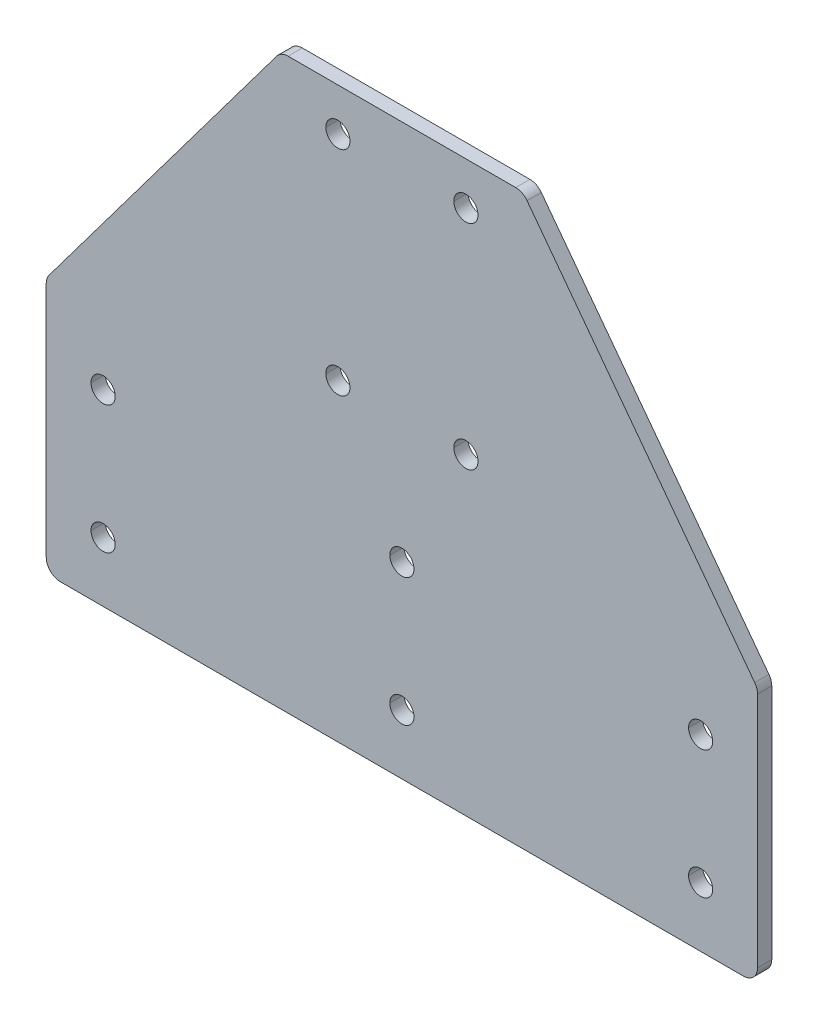
ISO-10303-21;
HEADER;
FILE_DESCRIPTION(('STEP AP214'),'2;1');
FILE_NAME('part.step','',(''),(''),'','','');
FILE_SCHEMA(('AUTOMOTIVE_DESIGN { 1 0 10303 214 1 1 1 1 }'));
ENDSEC;
DATA;
#1=APPLICATION_CONTEXT('core data for automotive mechanical design processes');
#2=APPLICATION_PROTOCOL_DEFINITION('international standard','automotive_design',2000,#1);
#3=PRODUCT_CONTEXT('',#1,'mechanical');
#4=PRODUCT('Part','Part','',(#3));
#5=PRODUCT_RELATED_PRODUCT_CATEGORY('part','',(#4));
#6=PRODUCT_DEFINITION_FORMATION('','',#4);
#7=PRODUCT_DEFINITION_CONTEXT('part definition',#1,'design');
#8=PRODUCT_DEFINITION('design','',#6,#7);
#9=PRODUCT_DEFINITION_SHAPE('','',#8);
#10=(LENGTH_UNIT() NAMED_UNIT(*) SI_UNIT(.MILLI.,.METRE.));
#11=(NAMED_UNIT(*) PLANE_ANGLE_UNIT() SI_UNIT($,.RADIAN.));
#12=(NAMED_UNIT(*) SI_UNIT($,.STERADIAN.) SOLID_ANGLE_UNIT());
#13=UNCERTAINTY_MEASURE_WITH_UNIT(LENGTH_MEASURE(1.E-05),#10,'distance_accuracy_value','');
#14=(GEOMETRIC_REPRESENTATION_CONTEXT(3) GLOBAL_UNCERTAINTY_ASSIGNED_CONTEXT((#13)) GLOBAL_UNIT_ASSIGNED_CONTEXT((#10,
#11,#12)) REPRESENTATION_CONTEXT('',''));
#15=CARTESIAN_POINT('',(0.,0.,0.));
#16=DIRECTION('',(0.,0.,1.));
#17=DIRECTION('',(1.,0.,0.));
#18=AXIS2_PLACEMENT_3D('',#15,#16,#17);
#19=CARTESIAN_POINT('',(230.004921564745,21.,5.));
#20=DIRECTION('',(0.,0.,-1.));
#21=DIRECTION('',(-1.,0.,0.));
#22=AXIS2_PLACEMENT_3D('',#19,#20,#21);
#23=CYLINDRICAL_SURFACE('',#22,4.25);
#24=DIRECTION('',(0.,0.,-1.));
#25=VECTOR('',#24,1.);
#26=CARTESIAN_POINT('',(234.254921564745,21.,5.));
#27=LINE('',#26,#25);
#28=CARTESIAN_POINT('',(234.254921564745,21.,5.));
#29=VERTEX_POINT('',#28);
#30=CARTESIAN_POINT('',(234.254921564745,21.,0.));
#31=VERTEX_POINT('',#30);
#32=EDGE_CURVE('E618',#29,#31,#27,.T.);
#33=ORIENTED_EDGE('',*,*,#32,.F.);
#34=CARTESIAN_POINT('',(230.004921564745,21.,5.));
#35=DIRECTION('',(0.,0.,1.));
#36=DIRECTION('',(-1.,0.,0.));
#37=AXIS2_PLACEMENT_3D('',#34,#35,#36);
#38=CIRCLE('',#37,4.25);
#39=CARTESIAN_POINT('',(225.754921564745,21.,5.));
#40=VERTEX_POINT('',#39);
#41=EDGE_CURVE('E449',#29,#40,#38,.T.);
#42=ORIENTED_EDGE('',*,*,#41,.T.);
#43=DIRECTION('',(0.,0.,-1.));
#44=VECTOR('',#43,1.);
#45=CARTESIAN_POINT('',(225.754921564745,21.,5.));
#46=LINE('',#45,#44);
#47=CARTESIAN_POINT('',(225.754921564745,21.,0.));
#48=VERTEX_POINT('',#47);
#49=EDGE_CURVE('E625',#40,#48,#46,.T.);
#50=ORIENTED_EDGE('',*,*,#49,.T.);
#51=CARTESIAN_POINT('',(230.004921564745,21.,0.));
#52=DIRECTION('',(0.,0.,1.));
#53=DIRECTION('',(-1.,0.,0.));
#54=AXIS2_PLACEMENT_3D('',#51,#52,#53);
#55=CIRCLE('',#54,4.25);
#56=EDGE_CURVE('E309',#31,#48,#55,.T.);
#57=ORIENTED_EDGE('',*,*,#56,.F.);
#58=EDGE_LOOP('',(#33,#42,#50,#57));
#59=FACE_BOUND('',#58,.T.);
#60=ADVANCED_FACE('F16',(#59),#23,.F.);
#61=CARTESIAN_POINT('',(230.004921564745,66.,5.));
#62=DIRECTION('',(0.,0.,-1.));
#63=DIRECTION('',(-1.,0.,0.));
#64=AXIS2_PLACEMENT_3D('',#61,#62,#63);
#65=CYLINDRICAL_SURFACE('',#64,4.25);
#66=DIRECTION('',(0.,0.,-1.));
#67=VECTOR('',#66,1.);
#68=CARTESIAN_POINT('',(234.254921564745,66.,5.));
#69=LINE('',#68,#67);
#70=CARTESIAN_POINT('',(234.254921564745,66.,5.));
#71=VERTEX_POINT('',#70);
#72=CARTESIAN_POINT('',(234.254921564745,66.,0.));
#73=VERTEX_POINT('',#72);
#74=EDGE_CURVE('E332',#71,#73,#69,.T.);
#75=ORIENTED_EDGE('',*,*,#74,.F.);
#76=CARTESIAN_POINT('',(230.004921564745,66.,5.));
#77=DIRECTION('',(0.,0.,1.));
#78=DIRECTION('',(-1.,0.,0.));
#79=AXIS2_PLACEMENT_3D('',#76,#77,#78);
#80=CIRCLE('',#79,4.25);
#81=CARTESIAN_POINT('',(225.754921564745,66.,5.));
#82=VERTEX_POINT('',#81);
#83=EDGE_CURVE('E545',#71,#82,#80,.T.);
#84=ORIENTED_EDGE('',*,*,#83,.T.);
#85=DIRECTION('',(0.,0.,-1.));
#86=VECTOR('',#85,1.);
#87=CARTESIAN_POINT('',(225.754921564745,66.,5.));
#88=LINE('',#87,#86);
#89=CARTESIAN_POINT('',(225.754921564745,66.,0.));
#90=VERTEX_POINT('',#89);
#91=EDGE_CURVE('E328',#82,#90,#88,.T.);
#92=ORIENTED_EDGE('',*,*,#91,.T.);
#93=CARTESIAN_POINT('',(230.004921564745,66.,0.));
#94=DIRECTION('',(0.,0.,1.));
#95=DIRECTION('',(-1.,0.,0.));
#96=AXIS2_PLACEMENT_3D('',#93,#94,#95);
#97=CIRCLE('',#96,4.25);
#98=EDGE_CURVE('E486',#73,#90,#97,.T.);
#99=ORIENTED_EDGE('',*,*,#98,.F.);
#100=EDGE_LOOP('',(#75,#84,#92,#99));
#101=FACE_BOUND('',#100,.T.);
#102=ADVANCED_FACE('F709',(#101),#65,.F.);
#103=CARTESIAN_POINT('',(19.995078435255,66.,5.));
#104=DIRECTION('',(0.,0.,-1.));
#105=DIRECTION('',(-1.,0.,0.));
#106=AXIS2_PLACEMENT_3D('',#103,#104,#105);
#107=CYLINDRICAL_SURFACE('',#106,4.25);
#108=DIRECTION('',(0.,0.,-1.));
#109=VECTOR('',#108,1.);
#110=CARTESIAN_POINT('',(24.245078435255,66.,5.));
#111=LINE('',#110,#109);
#112=CARTESIAN_POINT('',(24.245078435255,66.,5.));
#113=VERTEX_POINT('',#112);
#114=CARTESIAN_POINT('',(24.245078435255,66.,0.));
#115=VERTEX_POINT('',#114);
#116=EDGE_CURVE('E302',#113,#115,#111,.T.);
#117=ORIENTED_EDGE('',*,*,#116,.F.);
#118=CARTESIAN_POINT('',(19.995078435255,66.,5.));
#119=DIRECTION('',(0.,0.,1.));
#120=DIRECTION('',(1.,0.,0.));
#121=AXIS2_PLACEMENT_3D('',#118,#119,#120);
#122=CIRCLE('',#121,4.25);
#123=CARTESIAN_POINT('',(15.745078435255,66.,5.));
#124=VERTEX_POINT('',#123);
#125=EDGE_CURVE('E452',#113,#124,#122,.T.);
#126=ORIENTED_EDGE('',*,*,#125,.T.);
#127=DIRECTION('',(0.,0.,-1.));
#128=VECTOR('',#127,1.);
#129=CARTESIAN_POINT('',(15.745078435255,66.,5.));
#130=LINE('',#129,#128);
#131=CARTESIAN_POINT('',(15.745078435255,66.,0.));
#132=VERTEX_POINT('',#131);
#133=EDGE_CURVE('E305',#124,#132,#130,.T.);
#134=ORIENTED_EDGE('',*,*,#133,.T.);
#135=CARTESIAN_POINT('',(19.995078435255,66.,0.));
#136=DIRECTION('',(0.,0.,1.));
#137=DIRECTION('',(1.,0.,0.));
#138=AXIS2_PLACEMENT_3D('',#135,#136,#137);
#139=CIRCLE('',#138,4.25);
#140=EDGE_CURVE('E298',#115,#132,#139,.T.);
#141=ORIENTED_EDGE('',*,*,#140,.F.);
#142=EDGE_LOOP('',(#117,#126,#134,#141));
#143=FACE_BOUND('',#142,.T.);
#144=ADVANCED_FACE('F300',(#143),#107,.F.);
#145=CARTESIAN_POINT('',(19.995078435255,21.,5.));
#146=DIRECTION('',(0.,0.,-1.));
#147=DIRECTION('',(-1.,0.,0.));
#148=AXIS2_PLACEMENT_3D('',#145,#146,#147);
#149=CYLINDRICAL_SURFACE('',#148,4.25);
#150=DIRECTION('',(0.,0.,-1.));
#151=VECTOR('',#150,1.);
#152=CARTESIAN_POINT('',(24.245078435255,21.,5.));
#153=LINE('',#152,#151);
#154=CARTESIAN_POINT('',(24.245078435255,21.,5.));
#155=VERTEX_POINT('',#154);
#156=CARTESIAN_POINT('',(24.245078435255,21.,0.));
#157=VERTEX_POINT('',#156);
#158=EDGE_CURVE('E358',#155,#157,#153,.T.);
#159=ORIENTED_EDGE('',*,*,#158,.F.);
#160=CARTESIAN_POINT('',(19.995078435255,21.,5.));
#161=DIRECTION('',(0.,0.,1.));
#162=DIRECTION('',(1.,0.,0.));
#163=AXIS2_PLACEMENT_3D('',#160,#161,#162);
#164=CIRCLE('',#163,4.25);
#165=CARTESIAN_POINT('',(15.745078435255,21.,5.));
#166=VERTEX_POINT('',#165);
#167=EDGE_CURVE('E508',#155,#166,#164,.T.);
#168=ORIENTED_EDGE('',*,*,#167,.T.);
#169=DIRECTION('',(0.,0.,-1.));
#170=VECTOR('',#169,1.);
#171=CARTESIAN_POINT('',(15.745078435255,21.,5.));
#172=LINE('',#171,#170);
#173=CARTESIAN_POINT('',(15.745078435255,21.,0.));
#174=VERTEX_POINT('',#173);
#175=EDGE_CURVE('E343',#166,#174,#172,.T.);
#176=ORIENTED_EDGE('',*,*,#175,.T.);
#177=CARTESIAN_POINT('',(19.995078435255,21.,0.));
#178=DIRECTION('',(0.,0.,1.));
#179=DIRECTION('',(1.,0.,0.));
#180=AXIS2_PLACEMENT_3D('',#177,#178,#179);
#181=CIRCLE('',#180,4.25);
#182=EDGE_CURVE('E482',#157,#174,#181,.T.);
#183=ORIENTED_EDGE('',*,*,#182,.F.);
#184=EDGE_LOOP('',(#159,#168,#176,#183));
#185=FACE_BOUND('',#184,.T.);
#186=ADVANCED_FACE('F1226',(#185),#149,.F.);
#187=CARTESIAN_POINT('',(125.,21.,5.));
#188=DIRECTION('',(0.,0.,-1.));
#189=DIRECTION('',(-1.,0.,0.));
#190=AXIS2_PLACEMENT_3D('',#187,#188,#189);
#191=CYLINDRICAL_SURFACE('',#190,4.25);
#192=DIRECTION('',(0.,0.,-1.));
#193=VECTOR('',#192,1.);
#194=CARTESIAN_POINT('',(129.25,21.,5.));
#195=LINE('',#194,#193);
#196=CARTESIAN_POINT('',(129.25,21.,5.));
#197=VERTEX_POINT('',#196);
#198=CARTESIAN_POINT('',(129.25,21.,0.));
#199=VERTEX_POINT('',#198);
#200=EDGE_CURVE('E386',#197,#199,#195,.T.);
#201=ORIENTED_EDGE('',*,*,#200,.F.);
#202=CARTESIAN_POINT('',(125.,21.,5.));
#203=DIRECTION('',(0.,0.,1.));
#204=DIRECTION('',(1.,0.,0.));
#205=AXIS2_PLACEMENT_3D('',#202,#203,#204);
#206=CIRCLE('',#205,4.25);
#207=CARTESIAN_POINT('',(120.75,21.,5.));
#208=VERTEX_POINT('',#207);
#209=EDGE_CURVE('E555',#197,#208,#206,.T.);
#210=ORIENTED_EDGE('',*,*,#209,.T.);
#211=DIRECTION('',(0.,0.,-1.));
#212=VECTOR('',#211,1.);
#213=CARTESIAN_POINT('',(120.75,21.,5.));
#214=LINE('',#213,#212);
#215=CARTESIAN_POINT('',(120.75,21.,0.));
#216=VERTEX_POINT('',#215);
#217=EDGE_CURVE('E341',#208,#216,#214,.T.);
#218=ORIENTED_EDGE('',*,*,#217,.T.);
#219=CARTESIAN_POINT('',(125.,21.,0.));
#220=DIRECTION('',(0.,0.,1.));
#221=DIRECTION('',(1.,0.,0.));
#222=AXIS2_PLACEMENT_3D('',#219,#220,#221);
#223=CIRCLE('',#222,4.25);
#224=EDGE_CURVE('E310',#199,#216,#223,.T.);
#225=ORIENTED_EDGE('',*,*,#224,.F.);
#226=EDGE_LOOP('',(#201,#210,#218,#225));
#227=FACE_BOUND('',#226,.T.);
#228=ADVANCED_FACE('F1217',(#227),#191,.F.);
#229=CARTESIAN_POINT('',(125.,66.,5.));
#230=DIRECTION('',(0.,0.,-1.));
#231=DIRECTION('',(-1.,0.,0.));
#232=AXIS2_PLACEMENT_3D('',#229,#230,#231);
#233=CYLINDRICAL_SURFACE('',#232,4.25);
#234=DIRECTION('',(0.,0.,-1.));
#235=VECTOR('',#234,1.);
#236=CARTESIAN_POINT('',(129.25,66.,5.));
#237=LINE('',#236,#235);
#238=CARTESIAN_POINT('',(129.25,66.,5.));
#239=VERTEX_POINT('',#238);
#240=CARTESIAN_POINT('',(129.25,66.,0.));
#241=VERTEX_POINT('',#240);
#242=EDGE_CURVE('E340',#239,#241,#237,.T.);
#243=ORIENTED_EDGE('',*,*,#242,.F.);
#244=CARTESIAN_POINT('',(125.,66.,5.));
#245=DIRECTION('',(0.,0.,1.));
#246=DIRECTION('',(1.,0.,0.));
#247=AXIS2_PLACEMENT_3D('',#244,#245,#246);
#248=CIRCLE('',#247,4.25);
#249=CARTESIAN_POINT('',(120.75,66.,5.));
#250=VERTEX_POINT('',#249);
#251=EDGE_CURVE('E505',#239,#250,#248,.T.);
#252=ORIENTED_EDGE('',*,*,#251,.T.);
#253=DIRECTION('',(0.,0.,-1.));
#254=VECTOR('',#253,1.);
#255=CARTESIAN_POINT('',(120.75,66.,5.));
#256=LINE('',#255,#254);
#257=CARTESIAN_POINT('',(120.75,66.,0.));
#258=VERTEX_POINT('',#257);
#259=EDGE_CURVE('E379',#250,#258,#256,.T.);
#260=ORIENTED_EDGE('',*,*,#259,.T.);
#261=CARTESIAN_POINT('',(125.,66.,0.));
#262=DIRECTION('',(0.,0.,1.));
#263=DIRECTION('',(1.,0.,0.));
#264=AXIS2_PLACEMENT_3D('',#261,#262,#263);
#265=CIRCLE('',#264,4.25);
#266=EDGE_CURVE('E485',#241,#258,#265,.T.);
#267=ORIENTED_EDGE('',*,*,#266,.F.);
#268=EDGE_LOOP('',(#243,#252,#260,#267));
#269=FACE_BOUND('',#268,.T.);
#270=ADVANCED_FACE('F1208',(#269),#233,.F.);
#271=CARTESIAN_POINT('',(102.5,110.,5.));
#272=DIRECTION('',(0.,0.,-1.));
#273=DIRECTION('',(-1.,0.,0.));
#274=AXIS2_PLACEMENT_3D('',#271,#272,#273);
#275=CYLINDRICAL_SURFACE('',#274,4.25);
#276=DIRECTION('',(0.,0.,-1.));
#277=VECTOR('',#276,1.);
#278=CARTESIAN_POINT('',(106.75,110.,5.));
#279=LINE('',#278,#277);
#280=CARTESIAN_POINT('',(106.75,110.,5.));
#281=VERTEX_POINT('',#280);
#282=CARTESIAN_POINT('',(106.75,110.,0.));
#283=VERTEX_POINT('',#282);
#284=EDGE_CURVE('E378',#281,#283,#279,.T.);
#285=ORIENTED_EDGE('',*,*,#284,.F.);
#286=CARTESIAN_POINT('',(102.5,110.,5.));
#287=DIRECTION('',(0.,0.,1.));
#288=DIRECTION('',(1.,0.,0.));
#289=AXIS2_PLACEMENT_3D('',#286,#287,#288);
#290=CIRCLE('',#289,4.25);
#291=CARTESIAN_POINT('',(98.25,110.,5.));
#292=VERTEX_POINT('',#291);
#293=EDGE_CURVE('E552',#281,#292,#290,.T.);
#294=ORIENTED_EDGE('',*,*,#293,.T.);
#295=DIRECTION('',(0.,0.,-1.));
#296=VECTOR('',#295,1.);
#297=CARTESIAN_POINT('',(98.25,110.,5.));
#298=LINE('',#297,#296);
#299=CARTESIAN_POINT('',(98.25,110.,0.));
#300=VERTEX_POINT('',#299);
#301=EDGE_CURVE('E428',#292,#300,#298,.T.);
#302=ORIENTED_EDGE('',*,*,#301,.T.);
#303=CARTESIAN_POINT('',(102.5,110.,0.));
#304=DIRECTION('',(0.,0.,1.));
#305=DIRECTION('',(1.,0.,0.));
#306=AXIS2_PLACEMENT_3D('',#303,#304,#305);
#307=CIRCLE('',#306,4.25);
#308=EDGE_CURVE('E520',#283,#300,#307,.T.);
#309=ORIENTED_EDGE('',*,*,#308,.F.);
#310=EDGE_LOOP('',(#285,#294,#302,#309));
#311=FACE_BOUND('',#310,.T.);
#312=ADVANCED_FACE('F1199',(#311),#275,.F.);
#313=CARTESIAN_POINT('',(147.5,110.,5.));
#314=DIRECTION('',(0.,0.,-1.));
#315=DIRECTION('',(-1.,0.,0.));
#316=AXIS2_PLACEMENT_3D('',#313,#314,#315);
#317=CYLINDRICAL_SURFACE('',#316,4.25);
#318=DIRECTION('',(0.,0.,-1.));
#319=VECTOR('',#318,1.);
#320=CARTESIAN_POINT('',(151.75,110.,5.));
#321=LINE('',#320,#319);
#322=CARTESIAN_POINT('',(151.75,110.,5.));
#323=VERTEX_POINT('',#322);
#324=CARTESIAN_POINT('',(151.75,110.,0.));
#325=VERTEX_POINT('',#324);
#326=EDGE_CURVE('E440',#323,#325,#321,.T.);
#327=ORIENTED_EDGE('',*,*,#326,.F.);
#328=CARTESIAN_POINT('',(147.5,110.,5.));
#329=DIRECTION('',(0.,0.,1.));
#330=DIRECTION('',(-1.,0.,0.));
#331=AXIS2_PLACEMENT_3D('',#328,#329,#330);
#332=CIRCLE('',#331,4.25);
#333=CARTESIAN_POINT('',(143.25,110.,5.));
#334=VERTEX_POINT('',#333);
#335=EDGE_CURVE('E401',#323,#334,#332,.T.);
#336=ORIENTED_EDGE('',*,*,#335,.T.);
#337=DIRECTION('',(0.,0.,-1.));
#338=VECTOR('',#337,1.);
#339=CARTESIAN_POINT('',(143.25,110.,5.));
#340=LINE('',#339,#338);
#341=CARTESIAN_POINT('',(143.25,110.,0.));
#342=VERTEX_POINT('',#341);
#343=EDGE_CURVE('E448',#334,#342,#340,.T.);
#344=ORIENTED_EDGE('',*,*,#343,.T.);
#345=CARTESIAN_POINT('',(147.5,110.,0.));
#346=DIRECTION('',(0.,0.,1.));
#347=DIRECTION('',(-1.,0.,0.));
#348=AXIS2_PLACEMENT_3D('',#345,#346,#347);
#349=CIRCLE('',#348,4.25);
#350=EDGE_CURVE('E504',#325,#342,#349,.T.);
#351=ORIENTED_EDGE('',*,*,#350,.F.);
#352=EDGE_LOOP('',(#327,#336,#344,#351));
#353=FACE_BOUND('',#352,.T.);
#354=ADVANCED_FACE('F1190',(#353),#317,.F.);
#355=CARTESIAN_POINT('',(147.5,185.,5.));
#356=DIRECTION('',(0.,0.,-1.));
#357=DIRECTION('',(-1.,0.,0.));
#358=AXIS2_PLACEMENT_3D('',#355,#356,#357);
#359=CYLINDRICAL_SURFACE('',#358,4.25);
#360=DIRECTION('',(0.,0.,-1.));
#361=VECTOR('',#360,1.);
#362=CARTESIAN_POINT('',(151.75,185.,5.));
#363=LINE('',#362,#361);
#364=CARTESIAN_POINT('',(151.75,185.,5.));
#365=VERTEX_POINT('',#364);
#366=CARTESIAN_POINT('',(151.75,185.,0.));
#367=VERTEX_POINT('',#366);
#368=EDGE_CURVE('E460',#365,#367,#363,.T.);
#369=ORIENTED_EDGE('',*,*,#368,.F.);
#370=CARTESIAN_POINT('',(147.5,185.,5.));
#371=DIRECTION('',(0.,0.,1.));
#372=DIRECTION('',(-1.,0.,0.));
#373=AXIS2_PLACEMENT_3D('',#370,#371,#372);
#374=CIRCLE('',#373,4.25);
#375=CARTESIAN_POINT('',(143.25,185.,5.));
#376=VERTEX_POINT('',#375);
#377=EDGE_CURVE('E400',#365,#376,#374,.T.);
#378=ORIENTED_EDGE('',*,*,#377,.T.);
#379=DIRECTION('',(0.,0.,-1.));
#380=VECTOR('',#379,1.);
#381=CARTESIAN_POINT('',(143.25,185.,5.));
#382=LINE('',#381,#380);
#383=CARTESIAN_POINT('',(143.25,185.,0.));
#384=VERTEX_POINT('',#383);
#385=EDGE_CURVE('E417',#376,#384,#382,.T.);
#386=ORIENTED_EDGE('',*,*,#385,.T.);
#387=CARTESIAN_POINT('',(147.5,185.,0.));
#388=DIRECTION('',(0.,0.,1.));
#389=DIRECTION('',(-1.,0.,0.));
#390=AXIS2_PLACEMENT_3D('',#387,#388,#389);
#391=CIRCLE('',#390,4.25);
#392=EDGE_CURVE('E523',#367,#384,#391,.T.);
#393=ORIENTED_EDGE('',*,*,#392,.F.);
#394=EDGE_LOOP('',(#369,#378,#386,#393));
#395=FACE_BOUND('',#394,.T.);
#396=ADVANCED_FACE('F1181',(#395),#359,.F.);
#397=CARTESIAN_POINT('',(102.5,185.,5.));
#398=DIRECTION('',(0.,0.,-1.));
#399=DIRECTION('',(-1.,0.,0.));
#400=AXIS2_PLACEMENT_3D('',#397,#398,#399);
#401=CYLINDRICAL_SURFACE('',#400,4.25);
#402=DIRECTION('',(0.,0.,-1.));
#403=VECTOR('',#402,1.);
#404=CARTESIAN_POINT('',(106.75,185.,5.));
#405=LINE('',#404,#403);
#406=CARTESIAN_POINT('',(106.75,185.,5.));
#407=VERTEX_POINT('',#406);
#408=CARTESIAN_POINT('',(106.75,185.,0.));
#409=VERTEX_POINT('',#408);
#410=EDGE_CURVE('E416',#407,#409,#405,.T.);
#411=ORIENTED_EDGE('',*,*,#410,.F.);
#412=CARTESIAN_POINT('',(102.5,185.,5.));
#413=DIRECTION('',(0.,0.,1.));
#414=DIRECTION('',(1.,0.,0.));
#415=AXIS2_PLACEMENT_3D('',#412,#413,#414);
#416=CIRCLE('',#415,4.25);
#417=CARTESIAN_POINT('',(98.25,185.,5.));
#418=VERTEX_POINT('',#417);
#419=EDGE_CURVE('E397',#407,#418,#416,.T.);
#420=ORIENTED_EDGE('',*,*,#419,.T.);
#421=DIRECTION('',(0.,0.,-1.));
#422=VECTOR('',#421,1.);
#423=CARTESIAN_POINT('',(98.25,185.,5.));
#424=LINE('',#423,#422);
#425=CARTESIAN_POINT('',(98.25,185.,0.));
#426=VERTEX_POINT('',#425);
#427=EDGE_CURVE('E373',#418,#426,#424,.T.);
#428=ORIENTED_EDGE('',*,*,#427,.T.);
#429=CARTESIAN_POINT('',(102.5,185.,0.));
#430=DIRECTION('',(0.,0.,1.));
#431=DIRECTION('',(1.,0.,0.));
#432=AXIS2_PLACEMENT_3D('',#429,#430,#431);
#433=CIRCLE('',#432,4.25);
#434=EDGE_CURVE('E581',#409,#426,#433,.T.);
#435=ORIENTED_EDGE('',*,*,#434,.F.);
#436=EDGE_LOOP('',(#411,#420,#428,#435));
#437=FACE_BOUND('',#436,.T.);
#438=ADVANCED_FACE('F1173',(#437),#401,.F.);
#439=CARTESIAN_POINT('',(249.,91.3333333333358,5.));
#440=DIRECTION('',(-0.8,-0.600000000000009,0.));
#441=DIRECTION('',(-0.600000000000009,0.8,0.));
#442=AXIS2_PLACEMENT_3D('',#439,#440,#441);
#443=PLANE('',#442);
#444=DIRECTION('',(-0.600000000000009,0.8,0.));
#445=VECTOR('',#444,1.);
#446=CARTESIAN_POINT('',(249.,91.3333333333358,0.));
#447=LINE('',#446,#445);
#448=CARTESIAN_POINT('',(249.,91.3333333333358,0.));
#449=VERTEX_POINT('',#448);
#450=CARTESIAN_POINT('',(169.,198.,0.));
#451=VERTEX_POINT('',#450);
#452=EDGE_CURVE('E352',#449,#451,#447,.T.);
#453=ORIENTED_EDGE('',*,*,#452,.T.);
#454=DIRECTION('',(0.,0.,-1.));
#455=VECTOR('',#454,1.);
#456=CARTESIAN_POINT('',(169.,198.,5.));
#457=LINE('',#456,#455);
#458=CARTESIAN_POINT('',(169.,198.,5.));
#459=VERTEX_POINT('',#458);
#460=EDGE_CURVE('E432',#459,#451,#457,.T.);
#461=ORIENTED_EDGE('',*,*,#460,.F.);
#462=DIRECTION('',(-0.600000000000009,0.8,0.));
#463=VECTOR('',#462,1.);
#464=CARTESIAN_POINT('',(249.,91.3333333333358,5.));
#465=LINE('',#464,#463);
#466=CARTESIAN_POINT('',(249.,91.3333333333358,5.));
#467=VERTEX_POINT('',#466);
#468=EDGE_CURVE('E541',#467,#459,#465,.T.);
#469=ORIENTED_EDGE('',*,*,#468,.F.);
#470=DIRECTION('',(0.,0.,-1.));
#471=VECTOR('',#470,1.);
#472=CARTESIAN_POINT('',(249.,91.3333333333358,5.));
#473=LINE('',#472,#471);
#474=EDGE_CURVE('E10',#467,#449,#473,.T.);
#475=ORIENTED_EDGE('',*,*,#474,.T.);
#476=EDGE_LOOP('',(#453,#461,#469,#475));
#477=FACE_BOUND('',#476,.T.);
#478=ADVANCED_FACE('F675',(#477),#443,.F.);
#479=CARTESIAN_POINT('',(245.,88.3333333333358,5.));
#480=DIRECTION('',(0.,0.,-1.));
#481=DIRECTION('',(-1.,0.,0.));
#482=AXIS2_PLACEMENT_3D('',#479,#480,#481);
#483=CYLINDRICAL_SURFACE('',#482,5.);
#484=CARTESIAN_POINT('',(245.,88.3333333333358,0.));
#485=DIRECTION('',(0.,0.,1.));
#486=DIRECTION('',(-1.,0.,0.));
#487=AXIS2_PLACEMENT_3D('',#484,#485,#486);
#488=CIRCLE('',#487,5.);
#489=CARTESIAN_POINT('',(250.,88.3333333333358,0.));
#490=VERTEX_POINT('',#489);
#491=EDGE_CURVE('E356',#490,#449,#488,.T.);
#492=ORIENTED_EDGE('',*,*,#491,.T.);
#493=ORIENTED_EDGE('',*,*,#474,.F.);
#494=CARTESIAN_POINT('',(245.,88.3333333333358,5.));
#495=DIRECTION('',(0.,0.,1.));
#496=DIRECTION('',(-1.,0.,0.));
#497=AXIS2_PLACEMENT_3D('',#494,#495,#496);
#498=CIRCLE('',#497,5.);
#499=CARTESIAN_POINT('',(250.,88.3333333333358,5.));
#500=VERTEX_POINT('',#499);
#501=EDGE_CURVE('E530',#500,#467,#498,.T.);
#502=ORIENTED_EDGE('',*,*,#501,.F.);
#503=DIRECTION('',(0.,0.,-1.));
#504=VECTOR('',#503,1.);
#505=CARTESIAN_POINT('',(250.,88.3333333333358,5.));
#506=LINE('',#505,#504);
#507=EDGE_CURVE('E24',#500,#490,#506,.T.);
#508=ORIENTED_EDGE('',*,*,#507,.T.);
#509=EDGE_LOOP('',(#492,#493,#502,#508));
#510=FACE_BOUND('',#509,.T.);
#511=ADVANCED_FACE('F671',(#510),#483,.T.);
#512=CARTESIAN_POINT('',(250.,5.,5.));
#513=DIRECTION('',(-1.,0.,0.));
#514=DIRECTION('',(0.,0.,1.));
#515=AXIS2_PLACEMENT_3D('',#512,#513,#514);
#516=PLANE('',#515);
#517=DIRECTION('',(0.,1.,0.));
#518=VECTOR('',#517,1.);
#519=CARTESIAN_POINT('',(250.,5.,0.));
#520=LINE('',#519,#518);
#521=CARTESIAN_POINT('',(250.,5.,0.));
#522=VERTEX_POINT('',#521);
#523=EDGE_CURVE('E493',#522,#490,#520,.T.);
#524=ORIENTED_EDGE('',*,*,#523,.T.);
#525=ORIENTED_EDGE('',*,*,#507,.F.);
#526=DIRECTION('',(0.,1.,0.));
#527=VECTOR('',#526,1.);
#528=CARTESIAN_POINT('',(250.,5.,5.));
#529=LINE('',#528,#527);
#530=CARTESIAN_POINT('',(250.,5.,5.));
#531=VERTEX_POINT('',#530);
#532=EDGE_CURVE('E527',#531,#500,#529,.T.);
#533=ORIENTED_EDGE('',*,*,#532,.F.);
#534=DIRECTION('',(0.,0.,-1.));
#535=VECTOR('',#534,1.);
#536=CARTESIAN_POINT('',(250.,5.,5.));
#537=LINE('',#536,#535);
#538=EDGE_CURVE('E477',#531,#522,#537,.T.);
#539=ORIENTED_EDGE('',*,*,#538,.T.);
#540=EDGE_LOOP('',(#524,#525,#533,#539));
#541=FACE_BOUND('',#540,.T.);
#542=ADVANCED_FACE('F666',(#541),#516,.F.);
#543=CARTESIAN_POINT('',(245.,5.,5.));
#544=DIRECTION('',(0.,0.,-1.));
#545=DIRECTION('',(-1.,0.,0.));
#546=AXIS2_PLACEMENT_3D('',#543,#544,#545);
#547=CYLINDRICAL_SURFACE('',#546,5.);
#548=CARTESIAN_POINT('',(245.,5.,0.));
#549=DIRECTION('',(0.,0.,1.));
#550=DIRECTION('',(1.,0.,0.));
#551=AXIS2_PLACEMENT_3D('',#548,#549,#550);
#552=CIRCLE('',#551,5.);
#553=CARTESIAN_POINT('',(245.,0.,0.));
#554=VERTEX_POINT('',#553);
#555=EDGE_CURVE('E497',#554,#522,#552,.T.);
#556=ORIENTED_EDGE('',*,*,#555,.T.);
#557=ORIENTED_EDGE('',*,*,#538,.F.);
#558=CARTESIAN_POINT('',(245.,5.,5.));
#559=DIRECTION('',(0.,0.,1.));
#560=DIRECTION('',(1.,0.,0.));
#561=AXIS2_PLACEMENT_3D('',#558,#559,#560);
#562=CIRCLE('',#561,5.);
#563=CARTESIAN_POINT('',(245.,0.,5.));
#564=VERTEX_POINT('',#563);
#565=EDGE_CURVE('E366',#564,#531,#562,.T.);
#566=ORIENTED_EDGE('',*,*,#565,.F.);
#567=DIRECTION('',(0.,0.,-1.));
#568=VECTOR('',#567,1.);
#569=CARTESIAN_POINT('',(245.,0.,5.));
#570=LINE('',#569,#568);
#571=EDGE_CURVE('E604',#564,#554,#570,.T.);
#572=ORIENTED_EDGE('',*,*,#571,.T.);
#573=EDGE_LOOP('',(#556,#557,#566,#572));
#574=FACE_BOUND('',#573,.T.);
#575=ADVANCED_FACE('F664',(#574),#547,.T.);
#576=CARTESIAN_POINT('',(5.,0.,5.));
#577=DIRECTION('',(0.,1.,0.));
#578=DIRECTION('',(1.,0.,0.));
#579=AXIS2_PLACEMENT_3D('',#576,#577,#578);
#580=PLANE('',#579);
#581=DIRECTION('',(1.,0.,0.));
#582=VECTOR('',#581,1.);
#583=CARTESIAN_POINT('',(5.,0.,0.));
#584=LINE('',#583,#582);
#585=CARTESIAN_POINT('',(5.,0.,0.));
#586=VERTEX_POINT('',#585);
#587=EDGE_CURVE('E566',#586,#554,#584,.T.);
#588=ORIENTED_EDGE('',*,*,#587,.T.);
#589=ORIENTED_EDGE('',*,*,#571,.F.);
#590=DIRECTION('',(1.,0.,0.));
#591=VECTOR('',#590,1.);
#592=CARTESIAN_POINT('',(5.,0.,5.));
#593=LINE('',#592,#591);
#594=CARTESIAN_POINT('',(5.,0.,5.));
#595=VERTEX_POINT('',#594);
#596=EDGE_CURVE('E362',#595,#564,#593,.T.);
#597=ORIENTED_EDGE('',*,*,#596,.F.);
#598=DIRECTION('',(0.,0.,-1.));
#599=VECTOR('',#598,1.);
#600=CARTESIAN_POINT('',(5.,0.,5.));
#601=LINE('',#600,#599);
#602=EDGE_CURVE('E602',#595,#586,#601,.T.);
#603=ORIENTED_EDGE('',*,*,#602,.T.);
#604=EDGE_LOOP('',(#588,#589,#597,#603));
#605=FACE_BOUND('',#604,.T.);
#606=ADVANCED_FACE('F661',(#605),#580,.F.);
#607=CARTESIAN_POINT('',(5.,5.,5.));
#608=DIRECTION('',(0.,0.,-1.));
#609=DIRECTION('',(-1.,0.,0.));
#610=AXIS2_PLACEMENT_3D('',#607,#608,#609);
#611=CYLINDRICAL_SURFACE('',#610,5.);
#612=CARTESIAN_POINT('',(5.,5.,0.));
#613=DIRECTION('',(0.,0.,1.));
#614=DIRECTION('',(1.,0.,0.));
#615=AXIS2_PLACEMENT_3D('',#612,#613,#614);
#616=CIRCLE('',#615,5.);
#617=CARTESIAN_POINT('',(0.,5.,0.));
#618=VERTEX_POINT('',#617);
#619=EDGE_CURVE('E537',#618,#586,#616,.T.);
#620=ORIENTED_EDGE('',*,*,#619,.T.);
#621=ORIENTED_EDGE('',*,*,#602,.F.);
#622=CARTESIAN_POINT('',(5.,5.,5.));
#623=DIRECTION('',(0.,0.,1.));
#624=DIRECTION('',(1.,0.,0.));
#625=AXIS2_PLACEMENT_3D('',#622,#623,#624);
#626=CIRCLE('',#625,5.);
#627=CARTESIAN_POINT('',(0.,5.,5.));
#628=VERTEX_POINT('',#627);
#629=EDGE_CURVE('E367',#628,#595,#626,.T.);
#630=ORIENTED_EDGE('',*,*,#629,.F.);
#631=DIRECTION('',(0.,0.,-1.));
#632=VECTOR('',#631,1.);
#633=CARTESIAN_POINT('',(0.,5.,5.));
#634=LINE('',#633,#632);
#635=EDGE_CURVE('E599',#628,#618,#634,.T.);
#636=ORIENTED_EDGE('',*,*,#635,.T.);
#637=EDGE_LOOP('',(#620,#621,#630,#636));
#638=FACE_BOUND('',#637,.T.);
#639=ADVANCED_FACE('F658',(#638),#611,.T.);
#640=CARTESIAN_POINT('',(0.,5.,5.));
#641=DIRECTION('',(1.,0.,0.));
#642=DIRECTION('',(0.,1.,0.));
#643=AXIS2_PLACEMENT_3D('',#640,#641,#642);
#644=PLANE('',#643);
#645=DIRECTION('',(0.,-1.,0.));
#646=VECTOR('',#645,1.);
#647=CARTESIAN_POINT('',(0.,5.,0.));
#648=LINE('',#647,#646);
#649=CARTESIAN_POINT('',(0.,88.3333333333358,0.));
#650=VERTEX_POINT('',#649);
#651=EDGE_CURVE('E532',#650,#618,#648,.T.);
#652=ORIENTED_EDGE('',*,*,#651,.T.);
#653=ORIENTED_EDGE('',*,*,#635,.F.);
#654=DIRECTION('',(0.,-1.,0.));
#655=VECTOR('',#654,1.);
#656=CARTESIAN_POINT('',(0.,5.,5.));
#657=LINE('',#656,#655);
#658=CARTESIAN_POINT('',(0.,88.3333333333358,5.));
#659=VERTEX_POINT('',#658);
#660=EDGE_CURVE('E516',#659,#628,#657,.T.);
#661=ORIENTED_EDGE('',*,*,#660,.F.);
#662=DIRECTION('',(0.,0.,-1.));
#663=VECTOR('',#662,1.);
#664=CARTESIAN_POINT('',(0.,88.3333333333358,5.));
#665=LINE('',#664,#663);
#666=EDGE_CURVE('E596',#659,#650,#665,.T.);
#667=ORIENTED_EDGE('',*,*,#666,.T.);
#668=EDGE_LOOP('',(#652,#653,#661,#667));
#669=FACE_BOUND('',#668,.T.);
#670=ADVANCED_FACE('F653',(#669),#644,.F.);
#671=CARTESIAN_POINT('',(5.,88.3333333333358,5.));
#672=DIRECTION('',(0.,0.,-1.));
#673=DIRECTION('',(-1.,0.,0.));
#674=AXIS2_PLACEMENT_3D('',#671,#672,#673);
#675=CYLINDRICAL_SURFACE('',#674,5.);
#676=CARTESIAN_POINT('',(5.,88.3333333333358,0.));
#677=DIRECTION('',(0.,0.,1.));
#678=DIRECTION('',(1.,0.,0.));
#679=AXIS2_PLACEMENT_3D('',#676,#677,#678);
#680=CIRCLE('',#679,5.);
#681=CARTESIAN_POINT('',(1.,91.3333333333358,0.));
#682=VERTEX_POINT('',#681);
#683=EDGE_CURVE('E536',#682,#650,#680,.T.);
#684=ORIENTED_EDGE('',*,*,#683,.T.);
#685=ORIENTED_EDGE('',*,*,#666,.F.);
#686=CARTESIAN_POINT('',(5.,88.3333333333358,5.));
#687=DIRECTION('',(0.,0.,1.));
#688=DIRECTION('',(1.,0.,0.));
#689=AXIS2_PLACEMENT_3D('',#686,#687,#688);
#690=CIRCLE('',#689,5.);
#691=CARTESIAN_POINT('',(1.,91.3333333333358,5.));
#692=VERTEX_POINT('',#691);
#693=EDGE_CURVE('E512',#692,#659,#690,.T.);
#694=ORIENTED_EDGE('',*,*,#693,.F.);
#695=DIRECTION('',(0.,0.,-1.));
#696=VECTOR('',#695,1.);
#697=CARTESIAN_POINT('',(1.,91.3333333333358,5.));
#698=LINE('',#697,#696);
#699=EDGE_CURVE('E396',#692,#682,#698,.T.);
#700=ORIENTED_EDGE('',*,*,#699,.T.);
#701=EDGE_LOOP('',(#684,#685,#694,#700));
#702=FACE_BOUND('',#701,.T.);
#703=ADVANCED_FACE('F649',(#702),#675,.T.);
#704=CARTESIAN_POINT('',(1.,91.3333333333358,5.));
#705=DIRECTION('',(0.8,-0.600000000000009,0.));
#706=DIRECTION('',(0.,0.,-1.));
#707=AXIS2_PLACEMENT_3D('',#704,#705,#706);
#708=PLANE('',#707);
#709=DIRECTION('',(-0.600000000000009,-0.8,0.));
#710=VECTOR('',#709,1.);
#711=CARTESIAN_POINT('',(1.,91.3333333333358,0.));
#712=LINE('',#711,#710);
#713=CARTESIAN_POINT('',(81.,198.,0.));
#714=VERTEX_POINT('',#713);
#715=EDGE_CURVE('E573',#714,#682,#712,.T.);
#716=ORIENTED_EDGE('',*,*,#715,.T.);
#717=ORIENTED_EDGE('',*,*,#699,.F.);
#718=DIRECTION('',(-0.600000000000009,-0.8,0.));
#719=VECTOR('',#718,1.);
#720=CARTESIAN_POINT('',(1.,91.3333333333358,5.));
#721=LINE('',#720,#719);
#722=CARTESIAN_POINT('',(81.,198.,5.));
#723=VERTEX_POINT('',#722);
#724=EDGE_CURVE('E501',#723,#692,#721,.T.);
#725=ORIENTED_EDGE('',*,*,#724,.F.);
#726=DIRECTION('',(0.,0.,-1.));
#727=VECTOR('',#726,1.);
#728=CARTESIAN_POINT('',(81.,198.,5.));
#729=LINE('',#728,#727);
#730=EDGE_CURVE('E48',#723,#714,#729,.T.);
#731=ORIENTED_EDGE('',*,*,#730,.T.);
#732=EDGE_LOOP('',(#716,#717,#725,#731));
#733=FACE_BOUND('',#732,.T.);
#734=ADVANCED_FACE('F686',(#733),#708,.F.);
#735=CARTESIAN_POINT('',(85.,195.,5.));
#736=DIRECTION('',(0.,0.,-1.));
#737=DIRECTION('',(-1.,0.,0.));
#738=AXIS2_PLACEMENT_3D('',#735,#736,#737);
#739=CYLINDRICAL_SURFACE('',#738,5.);
#740=CARTESIAN_POINT('',(85.,195.,0.));
#741=DIRECTION('',(0.,0.,1.));
#742=DIRECTION('',(1.,0.,0.));
#743=AXIS2_PLACEMENT_3D('',#740,#741,#742);
#744=CIRCLE('',#743,5.);
#745=CARTESIAN_POINT('',(85.,200.,0.));
#746=VERTEX_POINT('',#745);
#747=EDGE_CURVE('E576',#746,#714,#744,.T.);
#748=ORIENTED_EDGE('',*,*,#747,.T.);
#749=ORIENTED_EDGE('',*,*,#730,.F.);
#750=CARTESIAN_POINT('',(85.,195.,5.));
#751=DIRECTION('',(0.,0.,1.));
#752=DIRECTION('',(1.,0.,0.));
#753=AXIS2_PLACEMENT_3D('',#750,#751,#752);
#754=CIRCLE('',#753,5.);
#755=CARTESIAN_POINT('',(85.,200.,5.));
#756=VERTEX_POINT('',#755);
#757=EDGE_CURVE('E468',#756,#723,#754,.T.);
#758=ORIENTED_EDGE('',*,*,#757,.F.);
#759=DIRECTION('',(0.,0.,-1.));
#760=VECTOR('',#759,1.);
#761=CARTESIAN_POINT('',(85.,200.,5.));
#762=LINE('',#761,#760);
#763=EDGE_CURVE('E37',#756,#746,#762,.T.);
#764=ORIENTED_EDGE('',*,*,#763,.T.);
#765=EDGE_LOOP('',(#748,#749,#758,#764));
#766=FACE_BOUND('',#765,.T.);
#767=ADVANCED_FACE('F684',(#766),#739,.T.);
#768=CARTESIAN_POINT('',(165.,200.,5.));
#769=DIRECTION('',(0.,-1.,0.));
#770=DIRECTION('',(0.,0.,-1.));
#771=AXIS2_PLACEMENT_3D('',#768,#769,#770);
#772=PLANE('',#771);
#773=DIRECTION('',(-1.,0.,0.));
#774=VECTOR('',#773,1.);
#775=CARTESIAN_POINT('',(165.,200.,0.));
#776=LINE('',#775,#774);
#777=CARTESIAN_POINT('',(165.,200.,0.));
#778=VERTEX_POINT('',#777);
#779=EDGE_CURVE('E544',#778,#746,#776,.T.);
#780=ORIENTED_EDGE('',*,*,#779,.T.);
#781=ORIENTED_EDGE('',*,*,#763,.F.);
#782=DIRECTION('',(-1.,0.,0.));
#783=VECTOR('',#782,1.);
#784=CARTESIAN_POINT('',(165.,200.,5.));
#785=LINE('',#784,#783);
#786=CARTESIAN_POINT('',(165.,200.,5.));
#787=VERTEX_POINT('',#786);
#788=EDGE_CURVE('E372',#787,#756,#785,.T.);
#789=ORIENTED_EDGE('',*,*,#788,.F.);
#790=DIRECTION('',(0.,0.,-1.));
#791=VECTOR('',#790,1.);
#792=CARTESIAN_POINT('',(165.,200.,5.));
#793=LINE('',#792,#791);
#794=EDGE_CURVE('E429',#787,#778,#793,.T.);
#795=ORIENTED_EDGE('',*,*,#794,.T.);
#796=EDGE_LOOP('',(#780,#781,#789,#795));
#797=FACE_BOUND('',#796,.T.);
#798=ADVANCED_FACE('F681',(#797),#772,.F.);
#799=CARTESIAN_POINT('',(165.,195.,5.));
#800=DIRECTION('',(0.,0.,-1.));
#801=DIRECTION('',(-1.,0.,0.));
#802=AXIS2_PLACEMENT_3D('',#799,#800,#801);
#803=CYLINDRICAL_SURFACE('',#802,5.);
#804=CARTESIAN_POINT('',(165.,195.,0.));
#805=DIRECTION('',(0.,0.,1.));
#806=DIRECTION('',(-1.,0.,0.));
#807=AXIS2_PLACEMENT_3D('',#804,#805,#806);
#808=CIRCLE('',#807,5.);
#809=EDGE_CURVE('E357',#451,#778,#808,.T.);
#810=ORIENTED_EDGE('',*,*,#809,.T.);
#811=ORIENTED_EDGE('',*,*,#794,.F.);
#812=CARTESIAN_POINT('',(165.,195.,5.));
#813=DIRECTION('',(0.,0.,1.));
#814=DIRECTION('',(-1.,0.,0.));
#815=AXIS2_PLACEMENT_3D('',#812,#813,#814);
#816=CIRCLE('',#815,5.);
#817=EDGE_CURVE('E368',#459,#787,#816,.T.);
#818=ORIENTED_EDGE('',*,*,#817,.F.);
#819=ORIENTED_EDGE('',*,*,#460,.T.);
#820=EDGE_LOOP('',(#810,#811,#818,#819));
#821=FACE_BOUND('',#820,.T.);
#822=ADVANCED_FACE('F678',(#821),#803,.T.);
#823=CARTESIAN_POINT('',(165.,195.,0.));
#824=DIRECTION('',(0.,0.,-1.));
#825=DIRECTION('',(0.,-1.,0.));
#826=AXIS2_PLACEMENT_3D('',#823,#824,#825);
#827=PLANE('',#826);
#828=CARTESIAN_POINT('',(230.004921564745,21.,0.));
#829=DIRECTION('',(0.,0.,1.));
#830=DIRECTION('',(-1.,0.,0.));
#831=AXIS2_PLACEMENT_3D('',#828,#829,#830);
#832=CIRCLE('',#831,4.25);
#833=EDGE_CURVE('E621',#48,#31,#832,.T.);
#834=ORIENTED_EDGE('',*,*,#833,.T.);
#835=ORIENTED_EDGE('',*,*,#56,.T.);
#836=EDGE_LOOP('',(#834,#835));
#837=FACE_BOUND('',#836,.T.);
#838=CARTESIAN_POINT('',(19.995078435255,66.,0.));
#839=DIRECTION('',(0.,0.,1.));
#840=DIRECTION('',(1.,0.,0.));
#841=AXIS2_PLACEMENT_3D('',#838,#839,#840);
#842=CIRCLE('',#841,4.25);
#843=EDGE_CURVE('E312',#132,#115,#842,.T.);
#844=ORIENTED_EDGE('',*,*,#843,.T.);
#845=ORIENTED_EDGE('',*,*,#140,.T.);
#846=EDGE_LOOP('',(#844,#845));
#847=FACE_BOUND('',#846,.T.);
#848=CARTESIAN_POINT('',(125.,21.,0.));
#849=DIRECTION('',(0.,0.,1.));
#850=DIRECTION('',(1.,0.,0.));
#851=AXIS2_PLACEMENT_3D('',#848,#849,#850);
#852=CIRCLE('',#851,4.25);
#853=EDGE_CURVE('E390',#216,#199,#852,.T.);
#854=ORIENTED_EDGE('',*,*,#853,.T.);
#855=ORIENTED_EDGE('',*,*,#224,.T.);
#856=EDGE_LOOP('',(#854,#855));
#857=FACE_BOUND('',#856,.T.);
#858=CARTESIAN_POINT('',(102.5,110.,0.));
#859=DIRECTION('',(0.,0.,1.));
#860=DIRECTION('',(1.,0.,0.));
#861=AXIS2_PLACEMENT_3D('',#858,#859,#860);
#862=CIRCLE('',#861,4.25);
#863=EDGE_CURVE('E424',#300,#283,#862,.T.);
#864=ORIENTED_EDGE('',*,*,#863,.T.);
#865=ORIENTED_EDGE('',*,*,#308,.T.);
#866=EDGE_LOOP('',(#864,#865));
#867=FACE_BOUND('',#866,.T.);
#868=CARTESIAN_POINT('',(147.5,185.,0.));
#869=DIRECTION('',(0.,0.,1.));
#870=DIRECTION('',(-1.,0.,0.));
#871=AXIS2_PLACEMENT_3D('',#868,#869,#870);
#872=CIRCLE('',#871,4.25);
#873=EDGE_CURVE('E464',#384,#367,#872,.T.);
#874=ORIENTED_EDGE('',*,*,#873,.T.);
#875=ORIENTED_EDGE('',*,*,#392,.T.);
#876=EDGE_LOOP('',(#874,#875));
#877=FACE_BOUND('',#876,.T.);
#878=CARTESIAN_POINT('',(102.5,185.,0.));
#879=DIRECTION('',(0.,0.,1.));
#880=DIRECTION('',(1.,0.,0.));
#881=AXIS2_PLACEMENT_3D('',#878,#879,#880);
#882=CIRCLE('',#881,4.25);
#883=EDGE_CURVE('E481',#426,#409,#882,.T.);
#884=ORIENTED_EDGE('',*,*,#883,.T.);
#885=ORIENTED_EDGE('',*,*,#434,.T.);
#886=EDGE_LOOP('',(#884,#885));
#887=FACE_BOUND('',#886,.T.);
#888=CARTESIAN_POINT('',(147.5,110.,0.));
#889=DIRECTION('',(0.,0.,1.));
#890=DIRECTION('',(-1.,0.,0.));
#891=AXIS2_PLACEMENT_3D('',#888,#889,#890);
#892=CIRCLE('',#891,4.25);
#893=EDGE_CURVE('E444',#342,#325,#892,.T.);
#894=ORIENTED_EDGE('',*,*,#893,.T.);
#895=ORIENTED_EDGE('',*,*,#350,.T.);
#896=EDGE_LOOP('',(#894,#895));
#897=FACE_BOUND('',#896,.T.);
#898=CARTESIAN_POINT('',(125.,66.,0.));
#899=DIRECTION('',(0.,0.,1.));
#900=DIRECTION('',(1.,0.,0.));
#901=AXIS2_PLACEMENT_3D('',#898,#899,#900);
#902=CIRCLE('',#901,4.25);
#903=EDGE_CURVE('E408',#258,#241,#902,.T.);
#904=ORIENTED_EDGE('',*,*,#903,.T.);
#905=ORIENTED_EDGE('',*,*,#266,.T.);
#906=EDGE_LOOP('',(#904,#905));
#907=FACE_BOUND('',#906,.T.);
#908=CARTESIAN_POINT('',(19.995078435255,21.,0.));
#909=DIRECTION('',(0.,0.,1.));
#910=DIRECTION('',(1.,0.,0.));
#911=AXIS2_PLACEMENT_3D('',#908,#909,#910);
#912=CIRCLE('',#911,4.25);
#913=EDGE_CURVE('E348',#174,#157,#912,.T.);
#914=ORIENTED_EDGE('',*,*,#913,.T.);
#915=ORIENTED_EDGE('',*,*,#182,.T.);
#916=EDGE_LOOP('',(#914,#915));
#917=FACE_BOUND('',#916,.T.);
#918=CARTESIAN_POINT('',(230.004921564745,66.,0.));
#919=DIRECTION('',(0.,0.,1.));
#920=DIRECTION('',(-1.,0.,0.));
#921=AXIS2_PLACEMENT_3D('',#918,#919,#920);
#922=CIRCLE('',#921,4.25);
#923=EDGE_CURVE('E334',#90,#73,#922,.T.);
#924=ORIENTED_EDGE('',*,*,#923,.T.);
#925=ORIENTED_EDGE('',*,*,#98,.T.);
#926=EDGE_LOOP('',(#924,#925));
#927=FACE_BOUND('',#926,.T.);
#928=ORIENTED_EDGE('',*,*,#809,.F.);
#929=ORIENTED_EDGE('',*,*,#452,.F.);
#930=ORIENTED_EDGE('',*,*,#491,.F.);
#931=ORIENTED_EDGE('',*,*,#523,.F.);
#932=ORIENTED_EDGE('',*,*,#555,.F.);
#933=ORIENTED_EDGE('',*,*,#587,.F.);
#934=ORIENTED_EDGE('',*,*,#619,.F.);
#935=ORIENTED_EDGE('',*,*,#651,.F.);
#936=ORIENTED_EDGE('',*,*,#683,.F.);
#937=ORIENTED_EDGE('',*,*,#715,.F.);
#938=ORIENTED_EDGE('',*,*,#747,.F.);
#939=ORIENTED_EDGE('',*,*,#779,.F.);
#940=EDGE_LOOP('',(#928,#929,#930,#931,#932,#933,#934,#935,#936,#937,#938,#939));
#941=FACE_BOUND('',#940,.T.);
#942=ADVANCED_FACE('F313',(#837,#847,#857,#867,#877,#887,#897,#907,#917,#927,#941),#827,.T.);
#943=CARTESIAN_POINT('',(165.,195.,5.));
#944=DIRECTION('',(0.,0.,-1.));
#945=DIRECTION('',(0.,-1.,0.));
#946=AXIS2_PLACEMENT_3D('',#943,#944,#945);
#947=PLANE('',#946);
#948=CARTESIAN_POINT('',(230.004921564745,21.,5.));
#949=DIRECTION('',(0.,0.,1.));
#950=DIRECTION('',(-1.,0.,0.));
#951=AXIS2_PLACEMENT_3D('',#948,#949,#950);
#952=CIRCLE('',#951,4.25);
#953=EDGE_CURVE('E695',#40,#29,#952,.T.);
#954=ORIENTED_EDGE('',*,*,#953,.F.);
#955=ORIENTED_EDGE('',*,*,#41,.F.);
#956=EDGE_LOOP('',(#954,#955));
#957=FACE_BOUND('',#956,.T.);
#958=CARTESIAN_POINT('',(19.995078435255,66.,5.));
#959=DIRECTION('',(0.,0.,1.));
#960=DIRECTION('',(1.,0.,0.));
#961=AXIS2_PLACEMENT_3D('',#958,#959,#960);
#962=CIRCLE('',#961,4.25);
#963=EDGE_CURVE('E320',#124,#113,#962,.T.);
#964=ORIENTED_EDGE('',*,*,#963,.F.);
#965=ORIENTED_EDGE('',*,*,#125,.F.);
#966=EDGE_LOOP('',(#964,#965));
#967=FACE_BOUND('',#966,.T.);
#968=CARTESIAN_POINT('',(125.,21.,5.));
#969=DIRECTION('',(0.,0.,1.));
#970=DIRECTION('',(1.,0.,0.));
#971=AXIS2_PLACEMENT_3D('',#968,#969,#970);
#972=CIRCLE('',#971,4.25);
#973=EDGE_CURVE('E347',#208,#197,#972,.T.);
#974=ORIENTED_EDGE('',*,*,#973,.F.);
#975=ORIENTED_EDGE('',*,*,#209,.F.);
#976=EDGE_LOOP('',(#974,#975));
#977=FACE_BOUND('',#976,.T.);
#978=CARTESIAN_POINT('',(102.5,110.,5.));
#979=DIRECTION('',(0.,0.,1.));
#980=DIRECTION('',(1.,0.,0.));
#981=AXIS2_PLACEMENT_3D('',#978,#979,#980);
#982=CIRCLE('',#981,4.25);
#983=EDGE_CURVE('E374',#292,#281,#982,.T.);
#984=ORIENTED_EDGE('',*,*,#983,.F.);
#985=ORIENTED_EDGE('',*,*,#293,.F.);
#986=EDGE_LOOP('',(#984,#985));
#987=FACE_BOUND('',#986,.T.);
#988=CARTESIAN_POINT('',(147.5,185.,5.));
#989=DIRECTION('',(0.,0.,1.));
#990=DIRECTION('',(-1.,0.,0.));
#991=AXIS2_PLACEMENT_3D('',#988,#989,#990);
#992=CIRCLE('',#991,4.25);
#993=EDGE_CURVE('E456',#376,#365,#992,.T.);
#994=ORIENTED_EDGE('',*,*,#993,.F.);
#995=ORIENTED_EDGE('',*,*,#377,.F.);
#996=EDGE_LOOP('',(#994,#995));
#997=FACE_BOUND('',#996,.T.);
#998=CARTESIAN_POINT('',(102.5,185.,5.));
#999=DIRECTION('',(0.,0.,1.));
#1000=DIRECTION('',(1.,0.,0.));
#1001=AXIS2_PLACEMENT_3D('',#998,#999,#1000);
#1002=CIRCLE('',#1001,4.25);
#1003=EDGE_CURVE('E412',#418,#407,#1002,.T.);
#1004=ORIENTED_EDGE('',*,*,#1003,.F.);
#1005=ORIENTED_EDGE('',*,*,#419,.F.);
#1006=EDGE_LOOP('',(#1004,#1005));
#1007=FACE_BOUND('',#1006,.T.);
#1008=CARTESIAN_POINT('',(147.5,110.,5.));
#1009=DIRECTION('',(0.,0.,1.));
#1010=DIRECTION('',(-1.,0.,0.));
#1011=AXIS2_PLACEMENT_3D('',#1008,#1009,#1010);
#1012=CIRCLE('',#1011,4.25);
#1013=EDGE_CURVE('E436',#334,#323,#1012,.T.);
#1014=ORIENTED_EDGE('',*,*,#1013,.F.);
#1015=ORIENTED_EDGE('',*,*,#335,.F.);
#1016=EDGE_LOOP('',(#1014,#1015));
#1017=FACE_BOUND('',#1016,.T.);
#1018=CARTESIAN_POINT('',(125.,66.,5.));
#1019=DIRECTION('',(0.,0.,1.));
#1020=DIRECTION('',(1.,0.,0.));
#1021=AXIS2_PLACEMENT_3D('',#1018,#1019,#1020);
#1022=CIRCLE('',#1021,4.25);
#1023=EDGE_CURVE('E337',#250,#239,#1022,.T.);
#1024=ORIENTED_EDGE('',*,*,#1023,.F.);
#1025=ORIENTED_EDGE('',*,*,#251,.F.);
#1026=EDGE_LOOP('',(#1024,#1025));
#1027=FACE_BOUND('',#1026,.T.);
#1028=CARTESIAN_POINT('',(19.995078435255,21.,5.));
#1029=DIRECTION('',(0.,0.,1.));
#1030=DIRECTION('',(1.,0.,0.));
#1031=AXIS2_PLACEMENT_3D('',#1028,#1029,#1030);
#1032=CIRCLE('',#1031,4.25);
#1033=EDGE_CURVE('E351',#166,#155,#1032,.T.);
#1034=ORIENTED_EDGE('',*,*,#1033,.F.);
#1035=ORIENTED_EDGE('',*,*,#167,.F.);
#1036=EDGE_LOOP('',(#1034,#1035));
#1037=FACE_BOUND('',#1036,.T.);
#1038=CARTESIAN_POINT('',(230.004921564745,66.,5.));
#1039=DIRECTION('',(0.,0.,1.));
#1040=DIRECTION('',(-1.,0.,0.));
#1041=AXIS2_PLACEMENT_3D('',#1038,#1039,#1040);
#1042=CIRCLE('',#1041,4.25);
#1043=EDGE_CURVE('E637',#82,#71,#1042,.T.);
#1044=ORIENTED_EDGE('',*,*,#1043,.F.);
#1045=ORIENTED_EDGE('',*,*,#83,.F.);
#1046=EDGE_LOOP('',(#1044,#1045));
#1047=FACE_BOUND('',#1046,.T.);
#1048=ORIENTED_EDGE('',*,*,#817,.T.);
#1049=ORIENTED_EDGE('',*,*,#788,.T.);
#1050=ORIENTED_EDGE('',*,*,#757,.T.);
#1051=ORIENTED_EDGE('',*,*,#724,.T.);
#1052=ORIENTED_EDGE('',*,*,#693,.T.);
#1053=ORIENTED_EDGE('',*,*,#660,.T.);
#1054=ORIENTED_EDGE('',*,*,#629,.T.);
#1055=ORIENTED_EDGE('',*,*,#596,.T.);
#1056=ORIENTED_EDGE('',*,*,#565,.T.);
#1057=ORIENTED_EDGE('',*,*,#532,.T.);
#1058=ORIENTED_EDGE('',*,*,#501,.T.);
#1059=ORIENTED_EDGE('',*,*,#468,.T.);
#1060=EDGE_LOOP('',(#1048,#1049,#1050,#1051,#1052,#1053,#1054,#1055,#1056,#1057,#1058,#1059));
#1061=FACE_BOUND('',#1060,.T.);
#1062=ADVANCED_FACE('F646',(#957,#967,#977,#987,#997,#1007,#1017,#1027,#1037,#1047,#1061),#947,.F.);
#1063=CARTESIAN_POINT('',(102.5,185.,5.));
#1064=DIRECTION('',(0.,0.,-1.));
#1065=DIRECTION('',(-1.,0.,0.));
#1066=AXIS2_PLACEMENT_3D('',#1063,#1064,#1065);
#1067=CYLINDRICAL_SURFACE('',#1066,4.25);
#1068=ORIENTED_EDGE('',*,*,#1003,.T.);
#1069=ORIENTED_EDGE('',*,*,#410,.T.);
#1070=ORIENTED_EDGE('',*,*,#883,.F.);
#1071=ORIENTED_EDGE('',*,*,#427,.F.);
#1072=EDGE_LOOP('',(#1068,#1069,#1070,#1071));
#1073=FACE_BOUND('',#1072,.T.);
#1074=ADVANCED_FACE('F723',(#1073),#1067,.F.);
#1075=CARTESIAN_POINT('',(147.5,185.,5.));
#1076=DIRECTION('',(0.,0.,-1.));
#1077=DIRECTION('',(-1.,0.,0.));
#1078=AXIS2_PLACEMENT_3D('',#1075,#1076,#1077);
#1079=CYLINDRICAL_SURFACE('',#1078,4.25);
#1080=ORIENTED_EDGE('',*,*,#993,.T.);
#1081=ORIENTED_EDGE('',*,*,#368,.T.);
#1082=ORIENTED_EDGE('',*,*,#873,.F.);
#1083=ORIENTED_EDGE('',*,*,#385,.F.);
#1084=EDGE_LOOP('',(#1080,#1081,#1082,#1083));
#1085=FACE_BOUND('',#1084,.T.);
#1086=ADVANCED_FACE('F1080',(#1085),#1079,.F.);
#1087=CARTESIAN_POINT('',(147.5,110.,5.));
#1088=DIRECTION('',(0.,0.,-1.));
#1089=DIRECTION('',(-1.,0.,0.));
#1090=AXIS2_PLACEMENT_3D('',#1087,#1088,#1089);
#1091=CYLINDRICAL_SURFACE('',#1090,4.25);
#1092=ORIENTED_EDGE('',*,*,#1013,.T.);
#1093=ORIENTED_EDGE('',*,*,#326,.T.);
#1094=ORIENTED_EDGE('',*,*,#893,.F.);
#1095=ORIENTED_EDGE('',*,*,#343,.F.);
#1096=EDGE_LOOP('',(#1092,#1093,#1094,#1095));
#1097=FACE_BOUND('',#1096,.T.);
#1098=ADVANCED_FACE('F1071',(#1097),#1091,.F.);
#1099=CARTESIAN_POINT('',(102.5,110.,5.));
#1100=DIRECTION('',(0.,0.,-1.));
#1101=DIRECTION('',(-1.,0.,0.));
#1102=AXIS2_PLACEMENT_3D('',#1099,#1100,#1101);
#1103=CYLINDRICAL_SURFACE('',#1102,4.25);
#1104=ORIENTED_EDGE('',*,*,#983,.T.);
#1105=ORIENTED_EDGE('',*,*,#284,.T.);
#1106=ORIENTED_EDGE('',*,*,#863,.F.);
#1107=ORIENTED_EDGE('',*,*,#301,.F.);
#1108=EDGE_LOOP('',(#1104,#1105,#1106,#1107));
#1109=FACE_BOUND('',#1108,.T.);
#1110=ADVANCED_FACE('F1062',(#1109),#1103,.F.);
#1111=CARTESIAN_POINT('',(125.,66.,5.));
#1112=DIRECTION('',(0.,0.,-1.));
#1113=DIRECTION('',(-1.,0.,0.));
#1114=AXIS2_PLACEMENT_3D('',#1111,#1112,#1113);
#1115=CYLINDRICAL_SURFACE('',#1114,4.25);
#1116=ORIENTED_EDGE('',*,*,#1023,.T.);
#1117=ORIENTED_EDGE('',*,*,#242,.T.);
#1118=ORIENTED_EDGE('',*,*,#903,.F.);
#1119=ORIENTED_EDGE('',*,*,#259,.F.);
#1120=EDGE_LOOP('',(#1116,#1117,#1118,#1119));
#1121=FACE_BOUND('',#1120,.T.);
#1122=ADVANCED_FACE('F1019',(#1121),#1115,.F.);
#1123=CARTESIAN_POINT('',(125.,21.,5.));
#1124=DIRECTION('',(0.,0.,-1.));
#1125=DIRECTION('',(-1.,0.,0.));
#1126=AXIS2_PLACEMENT_3D('',#1123,#1124,#1125);
#1127=CYLINDRICAL_SURFACE('',#1126,4.25);
#1128=ORIENTED_EDGE('',*,*,#973,.T.);
#1129=ORIENTED_EDGE('',*,*,#200,.T.);
#1130=ORIENTED_EDGE('',*,*,#853,.F.);
#1131=ORIENTED_EDGE('',*,*,#217,.F.);
#1132=EDGE_LOOP('',(#1128,#1129,#1130,#1131));
#1133=FACE_BOUND('',#1132,.T.);
#1134=ADVANCED_FACE('F1014',(#1133),#1127,.F.);
#1135=CARTESIAN_POINT('',(19.995078435255,21.,5.));
#1136=DIRECTION('',(0.,0.,-1.));
#1137=DIRECTION('',(-1.,0.,0.));
#1138=AXIS2_PLACEMENT_3D('',#1135,#1136,#1137);
#1139=CYLINDRICAL_SURFACE('',#1138,4.25);
#1140=ORIENTED_EDGE('',*,*,#1033,.T.);
#1141=ORIENTED_EDGE('',*,*,#158,.T.);
#1142=ORIENTED_EDGE('',*,*,#913,.F.);
#1143=ORIENTED_EDGE('',*,*,#175,.F.);
#1144=EDGE_LOOP('',(#1140,#1141,#1142,#1143));
#1145=FACE_BOUND('',#1144,.T.);
#1146=ADVANCED_FACE('F1018',(#1145),#1139,.F.);
#1147=CARTESIAN_POINT('',(19.995078435255,66.,5.));
#1148=DIRECTION('',(0.,0.,-1.));
#1149=DIRECTION('',(-1.,0.,0.));
#1150=AXIS2_PLACEMENT_3D('',#1147,#1148,#1149);
#1151=CYLINDRICAL_SURFACE('',#1150,4.25);
#1152=ORIENTED_EDGE('',*,*,#963,.T.);
#1153=ORIENTED_EDGE('',*,*,#116,.T.);
#1154=ORIENTED_EDGE('',*,*,#843,.F.);
#1155=ORIENTED_EDGE('',*,*,#133,.F.);
#1156=EDGE_LOOP('',(#1152,#1153,#1154,#1155));
#1157=FACE_BOUND('',#1156,.T.);
#1158=ADVANCED_FACE('F318',(#1157),#1151,.F.);
#1159=CARTESIAN_POINT('',(230.004921564745,66.,5.));
#1160=DIRECTION('',(0.,0.,-1.));
#1161=DIRECTION('',(-1.,0.,0.));
#1162=AXIS2_PLACEMENT_3D('',#1159,#1160,#1161);
#1163=CYLINDRICAL_SURFACE('',#1162,4.25);
#1164=ORIENTED_EDGE('',*,*,#1043,.T.);
#1165=ORIENTED_EDGE('',*,*,#74,.T.);
#1166=ORIENTED_EDGE('',*,*,#923,.F.);
#1167=ORIENTED_EDGE('',*,*,#91,.F.);
#1168=EDGE_LOOP('',(#1164,#1165,#1166,#1167));
#1169=FACE_BOUND('',#1168,.T.);
#1170=ADVANCED_FACE('F713',(#1169),#1163,.F.);
#1171=CARTESIAN_POINT('',(230.004921564745,21.,5.));
#1172=DIRECTION('',(0.,0.,-1.));
#1173=DIRECTION('',(-1.,0.,0.));
#1174=AXIS2_PLACEMENT_3D('',#1171,#1172,#1173);
#1175=CYLINDRICAL_SURFACE('',#1174,4.25);
#1176=ORIENTED_EDGE('',*,*,#953,.T.);
#1177=ORIENTED_EDGE('',*,*,#32,.T.);
#1178=ORIENTED_EDGE('',*,*,#833,.F.);
#1179=ORIENTED_EDGE('',*,*,#49,.F.);
#1180=EDGE_LOOP('',(#1176,#1177,#1178,#1179));
#1181=FACE_BOUND('',#1180,.T.);
#1182=ADVANCED_FACE('F739',(#1181),#1175,.F.);
#1183=CLOSED_SHELL('',(#60,#102,#144,#186,#228,#270,#312,#354,#396,#438,#478,#511,#542,#575,
#606,#639,#670,#703,#734,#767,#798,#822,#942,#1062,#1074,#1086,#1098,#1110,#1122,#1134,#1146,
#1158,#1170,#1182));
#1184=MANIFOLD_SOLID_BREP('B1',#1183);
#1185=ADVANCED_BREP_SHAPE_REPRESENTATION('',(#18,#1184),#14);
#1186=SHAPE_DEFINITION_REPRESENTATION(#9,#1185);
ENDSEC;
END-ISO-10303-21;
